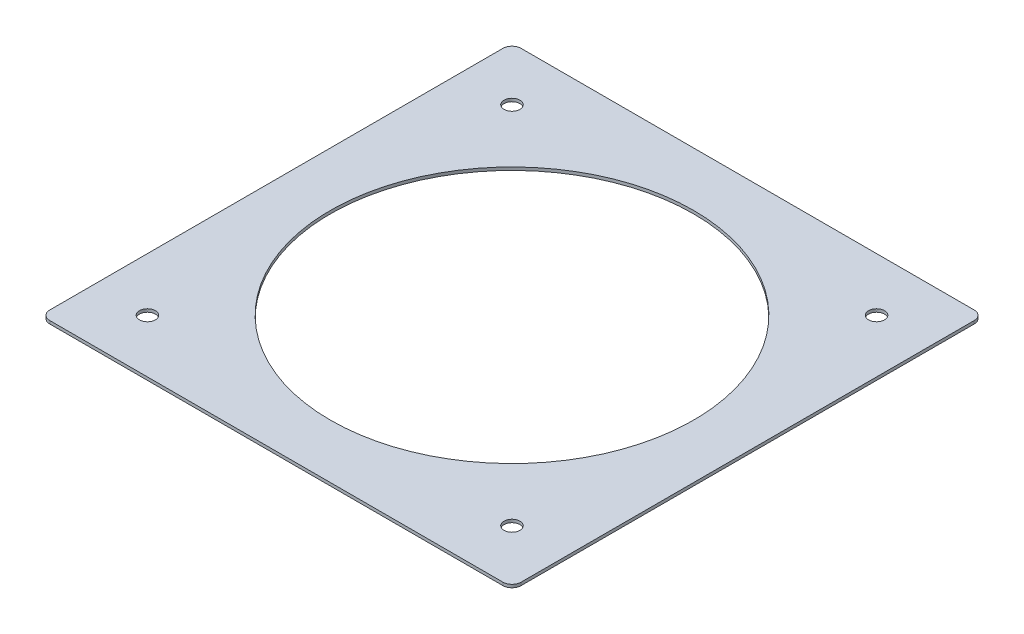
ISO-10303-21;
HEADER;
FILE_DESCRIPTION(('STEP AP214'),'2;1');
FILE_NAME('part.step','',(''),(''),'','','');
FILE_SCHEMA(('AUTOMOTIVE_DESIGN { 1 0 10303 214 1 1 1 1 }'));
ENDSEC;
DATA;
#1=APPLICATION_CONTEXT('core data for automotive mechanical design processes');
#2=APPLICATION_PROTOCOL_DEFINITION('international standard','automotive_design',2000,#1);
#3=PRODUCT_CONTEXT('',#1,'mechanical');
#4=PRODUCT('Part','Part','',(#3));
#5=PRODUCT_RELATED_PRODUCT_CATEGORY('part','',(#4));
#6=PRODUCT_DEFINITION_FORMATION('','',#4);
#7=PRODUCT_DEFINITION_CONTEXT('part definition',#1,'design');
#8=PRODUCT_DEFINITION('design','',#6,#7);
#9=PRODUCT_DEFINITION_SHAPE('','',#8);
#10=(LENGTH_UNIT() NAMED_UNIT(*) SI_UNIT(.MILLI.,.METRE.));
#11=(NAMED_UNIT(*) PLANE_ANGLE_UNIT() SI_UNIT($,.RADIAN.));
#12=(NAMED_UNIT(*) SI_UNIT($,.STERADIAN.) SOLID_ANGLE_UNIT());
#13=UNCERTAINTY_MEASURE_WITH_UNIT(LENGTH_MEASURE(1.E-05),#10,'distance_accuracy_value','');
#14=(GEOMETRIC_REPRESENTATION_CONTEXT(3) GLOBAL_UNCERTAINTY_ASSIGNED_CONTEXT((#13)) GLOBAL_UNIT_ASSIGNED_CONTEXT((#10,
#11,#12)) REPRESENTATION_CONTEXT('',''));
#15=CARTESIAN_POINT('',(0.,0.,0.));
#16=DIRECTION('',(0.,0.,1.));
#17=DIRECTION('',(1.,0.,0.));
#18=AXIS2_PLACEMENT_3D('',#15,#16,#17);
#19=CARTESIAN_POINT('',(77.4590674313275,1.,0.));
#20=DIRECTION('',(-1.,0.,0.));
#21=DIRECTION('',(0.,0.,1.));
#22=AXIS2_PLACEMENT_3D('',#19,#20,#21);
#23=PLANE('',#22);
#24=DIRECTION('',(0.,0.,-1.));
#25=VECTOR('',#24,1.);
#26=CARTESIAN_POINT('',(77.4590674313275,0.,0.));
#27=LINE('',#26,#25);
#28=CARTESIAN_POINT('',(77.4590674313275,0.,74.0531285438933));
#29=VERTEX_POINT('',#28);
#30=CARTESIAN_POINT('',(77.4590674313275,0.,-75.6224732138146));
#31=VERTEX_POINT('',#30);
#32=EDGE_CURVE('E158',#29,#31,#27,.T.);
#33=ORIENTED_EDGE('',*,*,#32,.T.);
#34=DIRECTION('',(0.,-1.,0.));
#35=VECTOR('',#34,1.);
#36=CARTESIAN_POINT('',(77.4590674313275,1.,-75.6224732138146));
#37=LINE('',#36,#35);
#38=CARTESIAN_POINT('',(77.4590674313275,1.,-75.6224732138146));
#39=VERTEX_POINT('',#38);
#40=EDGE_CURVE('E11',#39,#31,#37,.T.);
#41=ORIENTED_EDGE('',*,*,#40,.F.);
#42=DIRECTION('',(0.,0.,-1.));
#43=VECTOR('',#42,1.);
#44=CARTESIAN_POINT('',(77.4590674313275,1.,0.));
#45=LINE('',#44,#43);
#46=CARTESIAN_POINT('',(77.4590674313275,1.,74.0531285438933));
#47=VERTEX_POINT('',#46);
#48=EDGE_CURVE('E211',#47,#39,#45,.T.);
#49=ORIENTED_EDGE('',*,*,#48,.F.);
#50=DIRECTION('',(0.,-1.,0.));
#51=VECTOR('',#50,1.);
#52=CARTESIAN_POINT('',(77.4590674313275,1.,74.0531285438933));
#53=LINE('',#52,#51);
#54=EDGE_CURVE('E148',#47,#29,#53,.T.);
#55=ORIENTED_EDGE('',*,*,#54,.T.);
#56=EDGE_LOOP('',(#33,#41,#49,#55));
#57=FACE_BOUND('',#56,.T.);
#58=ADVANCED_FACE('F45',(#57),#23,.F.);
#59=CARTESIAN_POINT('',(74.4454647113736,1.,-75.6224732138146));
#60=DIRECTION('',(0.,-1.,0.));
#61=DIRECTION('',(0.,0.,-1.));
#62=AXIS2_PLACEMENT_3D('',#59,#60,#61);
#63=CYLINDRICAL_SURFACE('',#62,3.01360271995386);
#64=CARTESIAN_POINT('',(74.4454647113736,0.,-75.6224732138146));
#65=DIRECTION('',(0.,1.,0.));
#66=DIRECTION('',(0.,0.,1.));
#67=AXIS2_PLACEMENT_3D('',#64,#65,#66);
#68=CIRCLE('',#67,3.01360271995386);
#69=CARTESIAN_POINT('',(74.4454647113736,0.,-78.6360759337684));
#70=VERTEX_POINT('',#69);
#71=EDGE_CURVE('E161',#31,#70,#68,.T.);
#72=ORIENTED_EDGE('',*,*,#71,.T.);
#73=DIRECTION('',(0.,-1.,0.));
#74=VECTOR('',#73,1.);
#75=CARTESIAN_POINT('',(74.4454647113736,1.,-78.6360759337684));
#76=LINE('',#75,#74);
#77=CARTESIAN_POINT('',(74.4454647113736,1.,-78.6360759337684));
#78=VERTEX_POINT('',#77);
#79=EDGE_CURVE('E54',#78,#70,#76,.T.);
#80=ORIENTED_EDGE('',*,*,#79,.F.);
#81=CARTESIAN_POINT('',(74.4454647113736,1.,-75.6224732138146));
#82=DIRECTION('',(0.,1.,0.));
#83=DIRECTION('',(0.,0.,1.));
#84=AXIS2_PLACEMENT_3D('',#81,#82,#83);
#85=CIRCLE('',#84,3.01360271995386);
#86=EDGE_CURVE('E105',#39,#78,#85,.T.);
#87=ORIENTED_EDGE('',*,*,#86,.F.);
#88=ORIENTED_EDGE('',*,*,#40,.T.);
#89=EDGE_LOOP('',(#72,#80,#87,#88));
#90=FACE_BOUND('',#89,.T.);
#91=ADVANCED_FACE('F248',(#90),#63,.T.);
#92=CARTESIAN_POINT('',(0.,1.,-78.6360759337684));
#93=DIRECTION('',(0.,0.,1.));
#94=DIRECTION('',(1.,0.,0.));
#95=AXIS2_PLACEMENT_3D('',#92,#93,#94);
#96=PLANE('',#95);
#97=DIRECTION('',(-1.,0.,0.));
#98=VECTOR('',#97,1.);
#99=CARTESIAN_POINT('',(0.,0.,-78.6360759337684));
#100=LINE('',#99,#98);
#101=CARTESIAN_POINT('',(-75.2301370463343,0.,-78.6360759337684));
#102=VERTEX_POINT('',#101);
#103=EDGE_CURVE('E163',#70,#102,#100,.T.);
#104=ORIENTED_EDGE('',*,*,#103,.T.);
#105=DIRECTION('',(0.,-1.,0.));
#106=VECTOR('',#105,1.);
#107=CARTESIAN_POINT('',(-75.2301370463343,1.,-78.6360759337684));
#108=LINE('',#107,#106);
#109=CARTESIAN_POINT('',(-75.2301370463343,1.,-78.6360759337684));
#110=VERTEX_POINT('',#109);
#111=EDGE_CURVE('E185',#110,#102,#108,.T.);
#112=ORIENTED_EDGE('',*,*,#111,.F.);
#113=DIRECTION('',(-1.,0.,0.));
#114=VECTOR('',#113,1.);
#115=CARTESIAN_POINT('',(0.,1.,-78.6360759337684));
#116=LINE('',#115,#114);
#117=EDGE_CURVE('E193',#78,#110,#116,.T.);
#118=ORIENTED_EDGE('',*,*,#117,.F.);
#119=ORIENTED_EDGE('',*,*,#79,.T.);
#120=EDGE_LOOP('',(#104,#112,#118,#119));
#121=FACE_BOUND('',#120,.T.);
#122=ADVANCED_FACE('F191',(#121),#96,.F.);
#123=CARTESIAN_POINT('',(-75.2301370463343,1.,-75.6224732138146));
#124=DIRECTION('',(0.,-1.,0.));
#125=DIRECTION('',(0.,0.,-1.));
#126=AXIS2_PLACEMENT_3D('',#123,#124,#125);
#127=CYLINDRICAL_SURFACE('',#126,3.01360271995386);
#128=CARTESIAN_POINT('',(-75.2301370463343,0.,-75.6224732138146));
#129=DIRECTION('',(0.,1.,0.));
#130=DIRECTION('',(0.,0.,1.));
#131=AXIS2_PLACEMENT_3D('',#128,#129,#130);
#132=CIRCLE('',#131,3.01360271995386);
#133=CARTESIAN_POINT('',(-78.2437397662881,0.,-75.6224732138146));
#134=VERTEX_POINT('',#133);
#135=EDGE_CURVE('E165',#102,#134,#132,.T.);
#136=ORIENTED_EDGE('',*,*,#135,.T.);
#137=DIRECTION('',(0.,-1.,0.));
#138=VECTOR('',#137,1.);
#139=CARTESIAN_POINT('',(-78.2437397662881,1.,-75.6224732138146));
#140=LINE('',#139,#138);
#141=CARTESIAN_POINT('',(-78.2437397662881,1.,-75.6224732138146));
#142=VERTEX_POINT('',#141);
#143=EDGE_CURVE('E182',#142,#134,#140,.T.);
#144=ORIENTED_EDGE('',*,*,#143,.F.);
#145=CARTESIAN_POINT('',(-75.2301370463343,1.,-75.6224732138146));
#146=DIRECTION('',(0.,1.,0.));
#147=DIRECTION('',(0.,0.,1.));
#148=AXIS2_PLACEMENT_3D('',#145,#146,#147);
#149=CIRCLE('',#148,3.01360271995386);
#150=EDGE_CURVE('E206',#110,#142,#149,.T.);
#151=ORIENTED_EDGE('',*,*,#150,.F.);
#152=ORIENTED_EDGE('',*,*,#111,.T.);
#153=EDGE_LOOP('',(#136,#144,#151,#152));
#154=FACE_BOUND('',#153,.T.);
#155=ADVANCED_FACE('F202',(#154),#127,.T.);
#156=CARTESIAN_POINT('',(-78.2437397662881,1.,0.));
#157=DIRECTION('',(1.,0.,0.));
#158=DIRECTION('',(0.,0.,-1.));
#159=AXIS2_PLACEMENT_3D('',#156,#157,#158);
#160=PLANE('',#159);
#161=DIRECTION('',(0.,0.,1.));
#162=VECTOR('',#161,1.);
#163=CARTESIAN_POINT('',(-78.2437397662881,0.,0.));
#164=LINE('',#163,#162);
#165=CARTESIAN_POINT('',(-78.2437397662881,0.,74.0531285438933));
#166=VERTEX_POINT('',#165);
#167=EDGE_CURVE('E167',#134,#166,#164,.T.);
#168=ORIENTED_EDGE('',*,*,#167,.T.);
#169=DIRECTION('',(0.,-1.,0.));
#170=VECTOR('',#169,1.);
#171=CARTESIAN_POINT('',(-78.2437397662881,1.,74.0531285438933));
#172=LINE('',#171,#170);
#173=CARTESIAN_POINT('',(-78.2437397662881,1.,74.0531285438933));
#174=VERTEX_POINT('',#173);
#175=EDGE_CURVE('E134',#174,#166,#172,.T.);
#176=ORIENTED_EDGE('',*,*,#175,.F.);
#177=DIRECTION('',(0.,0.,1.));
#178=VECTOR('',#177,1.);
#179=CARTESIAN_POINT('',(-78.2437397662881,1.,0.));
#180=LINE('',#179,#178);
#181=EDGE_CURVE('E125',#142,#174,#180,.T.);
#182=ORIENTED_EDGE('',*,*,#181,.F.);
#183=ORIENTED_EDGE('',*,*,#143,.T.);
#184=EDGE_LOOP('',(#168,#176,#182,#183));
#185=FACE_BOUND('',#184,.T.);
#186=ADVANCED_FACE('F205',(#185),#160,.F.);
#187=CARTESIAN_POINT('',(-75.2301370463343,1.,74.0531285438933));
#188=DIRECTION('',(0.,-1.,0.));
#189=DIRECTION('',(0.,0.,-1.));
#190=AXIS2_PLACEMENT_3D('',#187,#188,#189);
#191=CYLINDRICAL_SURFACE('',#190,3.01360271995385);
#192=CARTESIAN_POINT('',(-75.2301370463343,0.,74.0531285438933));
#193=DIRECTION('',(0.,1.,0.));
#194=DIRECTION('',(0.,0.,1.));
#195=AXIS2_PLACEMENT_3D('',#192,#193,#194);
#196=CIRCLE('',#195,3.01360271995385);
#197=CARTESIAN_POINT('',(-75.2301370463343,0.,77.0667312638472));
#198=VERTEX_POINT('',#197);
#199=EDGE_CURVE('E133',#166,#198,#196,.T.);
#200=ORIENTED_EDGE('',*,*,#199,.T.);
#201=DIRECTION('',(0.,-1.,0.));
#202=VECTOR('',#201,1.);
#203=CARTESIAN_POINT('',(-75.2301370463343,1.,77.0667312638472));
#204=LINE('',#203,#202);
#205=CARTESIAN_POINT('',(-75.2301370463343,1.,77.0667312638472));
#206=VERTEX_POINT('',#205);
#207=EDGE_CURVE('E130',#206,#198,#204,.T.);
#208=ORIENTED_EDGE('',*,*,#207,.F.);
#209=CARTESIAN_POINT('',(-75.2301370463343,1.,74.0531285438933));
#210=DIRECTION('',(0.,1.,0.));
#211=DIRECTION('',(0.,0.,1.));
#212=AXIS2_PLACEMENT_3D('',#209,#210,#211);
#213=CIRCLE('',#212,3.01360271995385);
#214=EDGE_CURVE('E118',#174,#206,#213,.T.);
#215=ORIENTED_EDGE('',*,*,#214,.F.);
#216=ORIENTED_EDGE('',*,*,#175,.T.);
#217=EDGE_LOOP('',(#200,#208,#215,#216));
#218=FACE_BOUND('',#217,.T.);
#219=ADVANCED_FACE('F131',(#218),#191,.T.);
#220=CARTESIAN_POINT('',(0.,1.,77.0667312638472));
#221=DIRECTION('',(0.,0.,-1.));
#222=DIRECTION('',(-1.,0.,0.));
#223=AXIS2_PLACEMENT_3D('',#220,#221,#222);
#224=PLANE('',#223);
#225=DIRECTION('',(1.,0.,0.));
#226=VECTOR('',#225,1.);
#227=CARTESIAN_POINT('',(0.,0.,77.0667312638472));
#228=LINE('',#227,#226);
#229=CARTESIAN_POINT('',(74.4454647113736,0.,77.0667312638472));
#230=VERTEX_POINT('',#229);
#231=EDGE_CURVE('E91',#198,#230,#228,.T.);
#232=ORIENTED_EDGE('',*,*,#231,.T.);
#233=DIRECTION('',(0.,-1.,0.));
#234=VECTOR('',#233,1.);
#235=CARTESIAN_POINT('',(74.4454647113736,1.,77.0667312638472));
#236=LINE('',#235,#234);
#237=CARTESIAN_POINT('',(74.4454647113736,1.,77.0667312638472));
#238=VERTEX_POINT('',#237);
#239=EDGE_CURVE('E135',#238,#230,#236,.T.);
#240=ORIENTED_EDGE('',*,*,#239,.F.);
#241=DIRECTION('',(1.,0.,0.));
#242=VECTOR('',#241,1.);
#243=CARTESIAN_POINT('',(0.,1.,77.0667312638472));
#244=LINE('',#243,#242);
#245=EDGE_CURVE('E123',#206,#238,#244,.T.);
#246=ORIENTED_EDGE('',*,*,#245,.F.);
#247=ORIENTED_EDGE('',*,*,#207,.T.);
#248=EDGE_LOOP('',(#232,#240,#246,#247));
#249=FACE_BOUND('',#248,.T.);
#250=ADVANCED_FACE('F137',(#249),#224,.F.);
#251=CARTESIAN_POINT('',(59.8214251180902,1.,59.42908895061));
#252=DIRECTION('',(0.,-1.,0.));
#253=DIRECTION('',(0.,0.,-1.));
#254=AXIS2_PLACEMENT_3D('',#251,#252,#253);
#255=CYLINDRICAL_SURFACE('',#254,2.63764231323723);
#256=CARTESIAN_POINT('',(59.8214251180902,1.,59.42908895061));
#257=DIRECTION('',(0.,1.,0.));
#258=DIRECTION('',(0.,0.,1.));
#259=AXIS2_PLACEMENT_3D('',#256,#257,#258);
#260=CIRCLE('',#259,2.63764231323723);
#261=CARTESIAN_POINT('',(59.8214251180902,1.,62.0667312638472));
#262=VERTEX_POINT('',#261);
#263=EDGE_CURVE('E139',#262,#262,#260,.T.);
#264=ORIENTED_EDGE('',*,*,#263,.T.);
#265=EDGE_LOOP('',(#264));
#266=FACE_BOUND('',#265,.T.);
#267=CARTESIAN_POINT('',(59.8214251180902,0.,59.42908895061));
#268=DIRECTION('',(0.,1.,0.));
#269=DIRECTION('',(0.,0.,1.));
#270=AXIS2_PLACEMENT_3D('',#267,#268,#269);
#271=CIRCLE('',#270,2.63764231323723);
#272=CARTESIAN_POINT('',(59.8214251180902,0.,62.0667312638472));
#273=VERTEX_POINT('',#272);
#274=EDGE_CURVE('E172',#273,#273,#271,.T.);
#275=ORIENTED_EDGE('',*,*,#274,.F.);
#276=EDGE_LOOP('',(#275));
#277=FACE_BOUND('',#276,.T.);
#278=ADVANCED_FACE('F272',(#266,#277),#255,.F.);
#279=CARTESIAN_POINT('',(74.4454647113736,1.,74.0531285438933));
#280=DIRECTION('',(0.,-1.,0.));
#281=DIRECTION('',(0.,0.,-1.));
#282=AXIS2_PLACEMENT_3D('',#279,#280,#281);
#283=CYLINDRICAL_SURFACE('',#282,3.01360271995386);
#284=CARTESIAN_POINT('',(74.4454647113736,0.,74.0531285438933));
#285=DIRECTION('',(0.,1.,0.));
#286=DIRECTION('',(0.,0.,1.));
#287=AXIS2_PLACEMENT_3D('',#284,#285,#286);
#288=CIRCLE('',#287,3.01360271995386);
#289=EDGE_CURVE('E97',#230,#29,#288,.T.);
#290=ORIENTED_EDGE('',*,*,#289,.T.);
#291=ORIENTED_EDGE('',*,*,#54,.F.);
#292=CARTESIAN_POINT('',(74.4454647113736,1.,74.0531285438933));
#293=DIRECTION('',(0.,1.,0.));
#294=DIRECTION('',(0.,0.,1.));
#295=AXIS2_PLACEMENT_3D('',#292,#293,#294);
#296=CIRCLE('',#295,3.01360271995386);
#297=EDGE_CURVE('E62',#238,#47,#296,.T.);
#298=ORIENTED_EDGE('',*,*,#297,.F.);
#299=ORIENTED_EDGE('',*,*,#239,.T.);
#300=EDGE_LOOP('',(#290,#291,#298,#299));
#301=FACE_BOUND('',#300,.T.);
#302=ADVANCED_FACE('F236',(#301),#283,.T.);
#303=CARTESIAN_POINT('',(-60.6060974530509,1.,-60.9984336205312));
#304=DIRECTION('',(0.,-1.,0.));
#305=DIRECTION('',(0.,0.,-1.));
#306=AXIS2_PLACEMENT_3D('',#303,#304,#305);
#307=CYLINDRICAL_SURFACE('',#306,2.63764231323724);
#308=CARTESIAN_POINT('',(-60.6060974530509,1.,-60.9984336205312));
#309=DIRECTION('',(0.,1.,0.));
#310=DIRECTION('',(0.,0.,1.));
#311=AXIS2_PLACEMENT_3D('',#308,#309,#310);
#312=CIRCLE('',#311,2.63764231323724);
#313=CARTESIAN_POINT('',(-60.6060974530509,1.,-58.360791307294));
#314=VERTEX_POINT('',#313);
#315=EDGE_CURVE('E213',#314,#314,#312,.T.);
#316=ORIENTED_EDGE('',*,*,#315,.T.);
#317=EDGE_LOOP('',(#316));
#318=FACE_BOUND('',#317,.T.);
#319=CARTESIAN_POINT('',(-60.6060974530509,0.,-60.9984336205312));
#320=DIRECTION('',(0.,1.,0.));
#321=DIRECTION('',(0.,0.,1.));
#322=AXIS2_PLACEMENT_3D('',#319,#320,#321);
#323=CIRCLE('',#322,2.63764231323724);
#324=CARTESIAN_POINT('',(-60.6060974530509,0.,-58.360791307294));
#325=VERTEX_POINT('',#324);
#326=EDGE_CURVE('E155',#325,#325,#323,.T.);
#327=ORIENTED_EDGE('',*,*,#326,.F.);
#328=EDGE_LOOP('',(#327));
#329=FACE_BOUND('',#328,.T.);
#330=ADVANCED_FACE('F232',(#318,#329),#307,.F.);
#331=CARTESIAN_POINT('',(-60.6060974530509,1.,59.4290889506099));
#332=DIRECTION('',(0.,-1.,0.));
#333=DIRECTION('',(0.,0.,-1.));
#334=AXIS2_PLACEMENT_3D('',#331,#332,#333);
#335=CYLINDRICAL_SURFACE('',#334,2.63764231323724);
#336=CARTESIAN_POINT('',(-60.6060974530509,1.,59.4290889506099));
#337=DIRECTION('',(0.,1.,0.));
#338=DIRECTION('',(0.,0.,1.));
#339=AXIS2_PLACEMENT_3D('',#336,#337,#338);
#340=CIRCLE('',#339,2.63764231323724);
#341=CARTESIAN_POINT('',(-60.6060974530509,1.,62.0667312638472));
#342=VERTEX_POINT('',#341);
#343=EDGE_CURVE('E216',#342,#342,#340,.F.);
#344=ORIENTED_EDGE('',*,*,#343,.F.);
#345=EDGE_LOOP('',(#344));
#346=FACE_BOUND('',#345,.T.);
#347=CARTESIAN_POINT('',(-60.6060974530509,0.,59.4290889506099));
#348=DIRECTION('',(0.,1.,0.));
#349=DIRECTION('',(0.,0.,1.));
#350=AXIS2_PLACEMENT_3D('',#347,#348,#349);
#351=CIRCLE('',#350,2.63764231323724);
#352=CARTESIAN_POINT('',(-60.6060974530509,0.,62.0667312638472));
#353=VERTEX_POINT('',#352);
#354=EDGE_CURVE('E152',#353,#353,#351,.F.);
#355=ORIENTED_EDGE('',*,*,#354,.T.);
#356=EDGE_LOOP('',(#355));
#357=FACE_BOUND('',#356,.T.);
#358=ADVANCED_FACE('F235',(#346,#357),#335,.F.);
#359=CARTESIAN_POINT('',(-0.392336167480328,1.,-0.784672334960622));
#360=DIRECTION('',(0.,-1.,0.));
#361=DIRECTION('',(0.,0.,-1.));
#362=AXIS2_PLACEMENT_3D('',#359,#360,#361);
#363=CYLINDRICAL_SURFACE('',#362,60.);
#364=CARTESIAN_POINT('',(-0.392336167480328,1.,-0.784672334960622));
#365=DIRECTION('',(0.,1.,0.));
#366=DIRECTION('',(0.,0.,1.));
#367=AXIS2_PLACEMENT_3D('',#364,#365,#366);
#368=CIRCLE('',#367,60.);
#369=CARTESIAN_POINT('',(-0.392336167480328,1.,59.2153276650394));
#370=VERTEX_POINT('',#369);
#371=EDGE_CURVE('E178',#370,#370,#368,.T.);
#372=ORIENTED_EDGE('',*,*,#371,.T.);
#373=EDGE_LOOP('',(#372));
#374=FACE_BOUND('',#373,.T.);
#375=CARTESIAN_POINT('',(-0.392336167480328,0.,-0.784672334960622));
#376=DIRECTION('',(0.,1.,0.));
#377=DIRECTION('',(0.,0.,1.));
#378=AXIS2_PLACEMENT_3D('',#375,#376,#377);
#379=CIRCLE('',#378,60.);
#380=CARTESIAN_POINT('',(-0.392336167480328,0.,59.2153276650394));
#381=VERTEX_POINT('',#380);
#382=EDGE_CURVE('E149',#381,#381,#379,.T.);
#383=ORIENTED_EDGE('',*,*,#382,.F.);
#384=EDGE_LOOP('',(#383));
#385=FACE_BOUND('',#384,.T.);
#386=ADVANCED_FACE('F47',(#374,#385),#363,.F.);
#387=CARTESIAN_POINT('',(59.8214251180902,1.,-60.9984336205312));
#388=DIRECTION('',(0.,-1.,0.));
#389=DIRECTION('',(0.,0.,-1.));
#390=AXIS2_PLACEMENT_3D('',#387,#388,#389);
#391=CYLINDRICAL_SURFACE('',#390,2.63764231323724);
#392=CARTESIAN_POINT('',(59.8214251180902,1.,-60.9984336205312));
#393=DIRECTION('',(0.,1.,0.));
#394=DIRECTION('',(0.,0.,1.));
#395=AXIS2_PLACEMENT_3D('',#392,#393,#394);
#396=CIRCLE('',#395,2.63764231323724);
#397=CARTESIAN_POINT('',(59.8214251180902,1.,-58.360791307294));
#398=VERTEX_POINT('',#397);
#399=EDGE_CURVE('E145',#398,#398,#396,.F.);
#400=ORIENTED_EDGE('',*,*,#399,.F.);
#401=EDGE_LOOP('',(#400));
#402=FACE_BOUND('',#401,.T.);
#403=CARTESIAN_POINT('',(59.8214251180902,0.,-60.9984336205312));
#404=DIRECTION('',(0.,1.,0.));
#405=DIRECTION('',(0.,0.,1.));
#406=AXIS2_PLACEMENT_3D('',#403,#404,#405);
#407=CIRCLE('',#406,2.63764231323724);
#408=CARTESIAN_POINT('',(59.8214251180902,0.,-58.360791307294));
#409=VERTEX_POINT('',#408);
#410=EDGE_CURVE('E175',#409,#409,#407,.F.);
#411=ORIENTED_EDGE('',*,*,#410,.T.);
#412=EDGE_LOOP('',(#411));
#413=FACE_BOUND('',#412,.T.);
#414=ADVANCED_FACE('F226',(#402,#413),#391,.F.);
#415=CARTESIAN_POINT('',(0.,1.,0.));
#416=DIRECTION('',(0.,1.,0.));
#417=DIRECTION('',(0.,0.,1.));
#418=AXIS2_PLACEMENT_3D('',#415,#416,#417);
#419=PLANE('',#418);
#420=ORIENTED_EDGE('',*,*,#371,.F.);
#421=EDGE_LOOP('',(#420));
#422=FACE_BOUND('',#421,.T.);
#423=ORIENTED_EDGE('',*,*,#343,.T.);
#424=EDGE_LOOP('',(#423));
#425=FACE_BOUND('',#424,.T.);
#426=ORIENTED_EDGE('',*,*,#315,.F.);
#427=EDGE_LOOP('',(#426));
#428=FACE_BOUND('',#427,.T.);
#429=ORIENTED_EDGE('',*,*,#48,.T.);
#430=ORIENTED_EDGE('',*,*,#86,.T.);
#431=ORIENTED_EDGE('',*,*,#117,.T.);
#432=ORIENTED_EDGE('',*,*,#150,.T.);
#433=ORIENTED_EDGE('',*,*,#181,.T.);
#434=ORIENTED_EDGE('',*,*,#214,.T.);
#435=ORIENTED_EDGE('',*,*,#245,.T.);
#436=ORIENTED_EDGE('',*,*,#297,.T.);
#437=EDGE_LOOP('',(#429,#430,#431,#432,#433,#434,#435,#436));
#438=FACE_BOUND('',#437,.T.);
#439=ORIENTED_EDGE('',*,*,#263,.F.);
#440=EDGE_LOOP('',(#439));
#441=FACE_BOUND('',#440,.T.);
#442=ORIENTED_EDGE('',*,*,#399,.T.);
#443=EDGE_LOOP('',(#442));
#444=FACE_BOUND('',#443,.T.);
#445=ADVANCED_FACE('F120',(#422,#425,#428,#438,#441,#444),#419,.T.);
#446=CARTESIAN_POINT('',(0.,0.,0.));
#447=DIRECTION('',(0.,1.,0.));
#448=DIRECTION('',(0.,0.,1.));
#449=AXIS2_PLACEMENT_3D('',#446,#447,#448);
#450=PLANE('',#449);
#451=ORIENTED_EDGE('',*,*,#382,.T.);
#452=EDGE_LOOP('',(#451));
#453=FACE_BOUND('',#452,.T.);
#454=ORIENTED_EDGE('',*,*,#354,.F.);
#455=EDGE_LOOP('',(#454));
#456=FACE_BOUND('',#455,.T.);
#457=ORIENTED_EDGE('',*,*,#326,.T.);
#458=EDGE_LOOP('',(#457));
#459=FACE_BOUND('',#458,.T.);
#460=ORIENTED_EDGE('',*,*,#32,.F.);
#461=ORIENTED_EDGE('',*,*,#289,.F.);
#462=ORIENTED_EDGE('',*,*,#231,.F.);
#463=ORIENTED_EDGE('',*,*,#199,.F.);
#464=ORIENTED_EDGE('',*,*,#167,.F.);
#465=ORIENTED_EDGE('',*,*,#135,.F.);
#466=ORIENTED_EDGE('',*,*,#103,.F.);
#467=ORIENTED_EDGE('',*,*,#71,.F.);
#468=EDGE_LOOP('',(#460,#461,#462,#463,#464,#465,#466,#467));
#469=FACE_BOUND('',#468,.T.);
#470=ORIENTED_EDGE('',*,*,#274,.T.);
#471=EDGE_LOOP('',(#470));
#472=FACE_BOUND('',#471,.T.);
#473=ORIENTED_EDGE('',*,*,#410,.F.);
#474=EDGE_LOOP('',(#473));
#475=FACE_BOUND('',#474,.T.);
#476=ADVANCED_FACE('F197',(#453,#456,#459,#469,#472,#475),#450,.F.);
#477=CLOSED_SHELL('',(#58,#91,#122,#155,#186,#219,#250,#278,#302,#330,#358,#386,#414,#445,#476));
#478=MANIFOLD_SOLID_BREP('B2',#477);
#479=ADVANCED_BREP_SHAPE_REPRESENTATION('',(#18,#478),#14);
#480=SHAPE_DEFINITION_REPRESENTATION(#9,#479);
ENDSEC;
END-ISO-10303-21;
